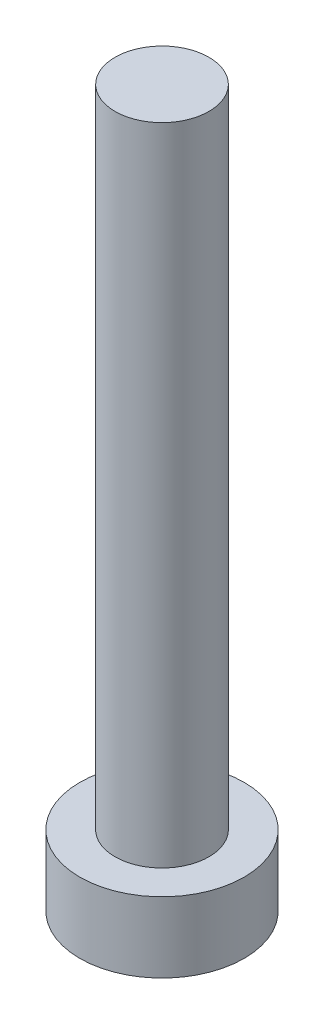
ISO-10303-21;
HEADER;
FILE_DESCRIPTION(('STEP AP214'),'2;1');
FILE_NAME('part.step','',(''),(''),'','','');
FILE_SCHEMA(('AUTOMOTIVE_DESIGN { 1 0 10303 214 1 1 1 1 }'));
ENDSEC;
DATA;
#1=APPLICATION_CONTEXT('core data for automotive mechanical design processes');
#2=APPLICATION_PROTOCOL_DEFINITION('international standard','automotive_design',2000,#1);
#3=PRODUCT_CONTEXT('',#1,'mechanical');
#4=PRODUCT('Part','Part','',(#3));
#5=PRODUCT_RELATED_PRODUCT_CATEGORY('part','',(#4));
#6=PRODUCT_DEFINITION_FORMATION('','',#4);
#7=PRODUCT_DEFINITION_CONTEXT('part definition',#1,'design');
#8=PRODUCT_DEFINITION('design','',#6,#7);
#9=PRODUCT_DEFINITION_SHAPE('','',#8);
#10=(LENGTH_UNIT() NAMED_UNIT(*) SI_UNIT(.MILLI.,.METRE.));
#11=(NAMED_UNIT(*) PLANE_ANGLE_UNIT() SI_UNIT($,.RADIAN.));
#12=(NAMED_UNIT(*) SI_UNIT($,.STERADIAN.) SOLID_ANGLE_UNIT());
#13=UNCERTAINTY_MEASURE_WITH_UNIT(LENGTH_MEASURE(1.E-05),#10,'distance_accuracy_value','');
#14=(GEOMETRIC_REPRESENTATION_CONTEXT(3) GLOBAL_UNCERTAINTY_ASSIGNED_CONTEXT((#13)) GLOBAL_UNIT_ASSIGNED_CONTEXT((#10,
#11,#12)) REPRESENTATION_CONTEXT('',''));
#15=CARTESIAN_POINT('',(0.,0.,0.));
#16=DIRECTION('',(0.,0.,1.));
#17=DIRECTION('',(1.,0.,0.));
#18=AXIS2_PLACEMENT_3D('',#15,#16,#17);
#19=CARTESIAN_POINT('',(0.,6.,0.));
#20=DIRECTION('',(0.,-1.,0.));
#21=DIRECTION('',(0.,0.,-1.));
#22=AXIS2_PLACEMENT_3D('',#19,#20,#21);
#23=CYLINDRICAL_SURFACE('',#22,7.);
#24=CARTESIAN_POINT('',(0.,6.,0.));
#25=DIRECTION('',(0.,1.,0.));
#26=DIRECTION('',(0.,0.,1.));
#27=AXIS2_PLACEMENT_3D('',#24,#25,#26);
#28=CIRCLE('',#27,7.);
#29=CARTESIAN_POINT('',(0.,6.,7.));
#30=VERTEX_POINT('',#29);
#31=EDGE_CURVE('E41',#30,#30,#28,.T.);
#32=ORIENTED_EDGE('',*,*,#31,.F.);
#33=EDGE_LOOP('',(#32));
#34=FACE_BOUND('',#33,.T.);
#35=CARTESIAN_POINT('',(0.,0.,0.));
#36=DIRECTION('',(0.,1.,0.));
#37=DIRECTION('',(0.,0.,1.));
#38=AXIS2_PLACEMENT_3D('',#35,#36,#37);
#39=CIRCLE('',#38,7.);
#40=CARTESIAN_POINT('',(0.,0.,7.));
#41=VERTEX_POINT('',#40);
#42=EDGE_CURVE('E37',#41,#41,#39,.T.);
#43=ORIENTED_EDGE('',*,*,#42,.T.);
#44=EDGE_LOOP('',(#43));
#45=FACE_BOUND('',#44,.T.);
#46=ADVANCED_FACE('F34',(#34,#45),#23,.T.);
#47=CARTESIAN_POINT('',(0.,6.,0.));
#48=DIRECTION('',(0.,1.,0.));
#49=DIRECTION('',(0.,0.,1.));
#50=AXIS2_PLACEMENT_3D('',#47,#48,#49);
#51=PLANE('',#50);
#52=CARTESIAN_POINT('',(0.,6.,0.));
#53=DIRECTION('',(0.,1.,0.));
#54=DIRECTION('',(0.,0.,1.));
#55=AXIS2_PLACEMENT_3D('',#52,#53,#54);
#56=CIRCLE('',#55,4.);
#57=CARTESIAN_POINT('',(0.,6.,4.));
#58=VERTEX_POINT('',#57);
#59=EDGE_CURVE('E10',#58,#58,#56,.T.);
#60=ORIENTED_EDGE('',*,*,#59,.F.);
#61=EDGE_LOOP('',(#60));
#62=FACE_BOUND('',#61,.T.);
#63=ORIENTED_EDGE('',*,*,#31,.T.);
#64=EDGE_LOOP('',(#63));
#65=FACE_BOUND('',#64,.T.);
#66=ADVANCED_FACE('F58',(#62,#65),#51,.T.);
#67=CARTESIAN_POINT('',(0.,0.,0.));
#68=DIRECTION('',(0.,1.,0.));
#69=DIRECTION('',(0.,0.,1.));
#70=AXIS2_PLACEMENT_3D('',#67,#68,#69);
#71=PLANE('',#70);
#72=ORIENTED_EDGE('',*,*,#42,.F.);
#73=EDGE_LOOP('',(#72));
#74=FACE_BOUND('',#73,.T.);
#75=ADVANCED_FACE('F55',(#74),#71,.F.);
#76=CARTESIAN_POINT('',(0.,61.,0.));
#77=DIRECTION('',(0.,-1.,0.));
#78=DIRECTION('',(0.,0.,-1.));
#79=AXIS2_PLACEMENT_3D('',#76,#77,#78);
#80=CYLINDRICAL_SURFACE('',#79,4.);
#81=CARTESIAN_POINT('',(0.,61.,0.));
#82=DIRECTION('',(0.,1.,0.));
#83=DIRECTION('',(0.,0.,1.));
#84=AXIS2_PLACEMENT_3D('',#81,#82,#83);
#85=CIRCLE('',#84,4.);
#86=CARTESIAN_POINT('',(0.,61.,4.));
#87=VERTEX_POINT('',#86);
#88=EDGE_CURVE('E47',#87,#87,#85,.T.);
#89=ORIENTED_EDGE('',*,*,#88,.F.);
#90=EDGE_LOOP('',(#89));
#91=FACE_BOUND('',#90,.T.);
#92=ORIENTED_EDGE('',*,*,#59,.T.);
#93=EDGE_LOOP('',(#92));
#94=FACE_BOUND('',#93,.T.);
#95=ADVANCED_FACE('F57',(#91,#94),#80,.T.);
#96=CARTESIAN_POINT('',(0.,61.,0.));
#97=DIRECTION('',(0.,1.,0.));
#98=DIRECTION('',(0.,0.,1.));
#99=AXIS2_PLACEMENT_3D('',#96,#97,#98);
#100=PLANE('',#99);
#101=ORIENTED_EDGE('',*,*,#88,.T.);
#102=EDGE_LOOP('',(#101));
#103=FACE_BOUND('',#102,.T.);
#104=ADVANCED_FACE('F63',(#103),#100,.T.);
#105=CLOSED_SHELL('',(#46,#66,#75,#95,#104));
#106=MANIFOLD_SOLID_BREP('B2',#105);
#107=ADVANCED_BREP_SHAPE_REPRESENTATION('',(#18,#106),#14);
#108=SHAPE_DEFINITION_REPRESENTATION(#9,#107);
ENDSEC;
END-ISO-10303-21;
